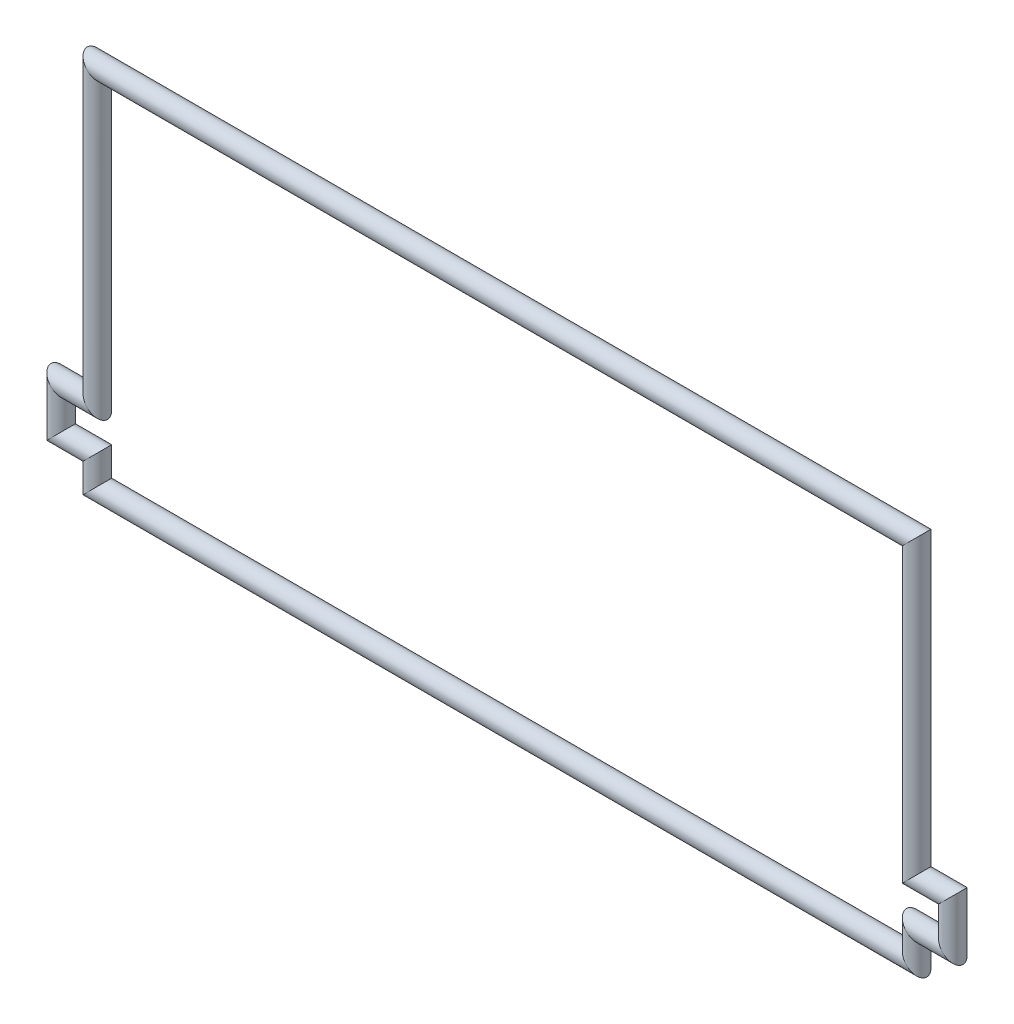
ISO-10303-21;
HEADER;
FILE_DESCRIPTION(('STEP AP214'),'2;1');
FILE_NAME('part.step','',(''),(''),'','','');
FILE_SCHEMA(('AUTOMOTIVE_DESIGN { 1 0 10303 214 1 1 1 1 }'));
ENDSEC;
DATA;
#1=APPLICATION_CONTEXT('core data for automotive mechanical design processes');
#2=APPLICATION_PROTOCOL_DEFINITION('international standard','automotive_design',2000,#1);
#3=PRODUCT_CONTEXT('',#1,'mechanical');
#4=PRODUCT('Part','Part','',(#3));
#5=PRODUCT_RELATED_PRODUCT_CATEGORY('part','',(#4));
#6=PRODUCT_DEFINITION_FORMATION('','',#4);
#7=PRODUCT_DEFINITION_CONTEXT('part definition',#1,'design');
#8=PRODUCT_DEFINITION('design','',#6,#7);
#9=PRODUCT_DEFINITION_SHAPE('','',#8);
#10=(LENGTH_UNIT() NAMED_UNIT(*) SI_UNIT(.MILLI.,.METRE.));
#11=(NAMED_UNIT(*) PLANE_ANGLE_UNIT() SI_UNIT($,.RADIAN.));
#12=(NAMED_UNIT(*) SI_UNIT($,.STERADIAN.) SOLID_ANGLE_UNIT());
#13=UNCERTAINTY_MEASURE_WITH_UNIT(LENGTH_MEASURE(1.E-05),#10,'distance_accuracy_value','');
#14=(GEOMETRIC_REPRESENTATION_CONTEXT(3) GLOBAL_UNCERTAINTY_ASSIGNED_CONTEXT((#13)) GLOBAL_UNIT_ASSIGNED_CONTEXT((#10,
#11,#12)) REPRESENTATION_CONTEXT('',''));
#15=CARTESIAN_POINT('',(0.,0.,0.));
#16=DIRECTION('',(0.,0.,1.));
#17=DIRECTION('',(1.,0.,0.));
#18=AXIS2_PLACEMENT_3D('',#15,#16,#17);
#19=CARTESIAN_POINT('',(58.14,25.2,0.));
#20=DIRECTION('',(-1.,0.,0.));
#21=DIRECTION('',(0.,0.,1.));
#22=AXIS2_PLACEMENT_3D('',#19,#20,#21);
#23=CYLINDRICAL_SURFACE('',#22,0.7);
#24=CARTESIAN_POINT('',(56.5,25.2,0.));
#25=DIRECTION('',(-0.707106781186548,0.707106781186547,0.));
#26=DIRECTION('',(0.707106781186547,0.707106781186548,0.));
#27=AXIS2_PLACEMENT_3D('',#24,#25,#26);
#28=ELLIPSE('',#27,0.989949493661166,0.7);
#29=CARTESIAN_POINT('',(57.2,25.9,0.));
#30=VERTEX_POINT('',#29);
#31=EDGE_CURVE('E60',#30,#30,#28,.F.);
#32=ORIENTED_EDGE('',*,*,#31,.F.);
#33=EDGE_LOOP('',(#32));
#34=FACE_BOUND('',#33,.T.);
#35=CARTESIAN_POINT('',(0.,25.2,0.));
#36=DIRECTION('',(-0.707106781186548,-0.707106781186548,0.));
#37=DIRECTION('',(0.707106781186548,-0.707106781186548,0.));
#38=AXIS2_PLACEMENT_3D('',#35,#36,#37);
#39=ELLIPSE('',#38,0.989949493661167,0.7);
#40=CARTESIAN_POINT('',(0.700000000000038,24.5,0.));
#41=VERTEX_POINT('',#40);
#42=EDGE_CURVE('E45',#41,#41,#39,.F.);
#43=ORIENTED_EDGE('',*,*,#42,.T.);
#44=EDGE_LOOP('',(#43));
#45=FACE_BOUND('',#44,.T.);
#46=ADVANCED_FACE('F42',(#34,#45),#23,.T.);
#47=CARTESIAN_POINT('',(0.,26.84,0.));
#48=DIRECTION('',(0.,-1.,0.));
#49=DIRECTION('',(0.,0.,-1.));
#50=AXIS2_PLACEMENT_3D('',#47,#48,#49);
#51=CYLINDRICAL_SURFACE('',#50,0.7);
#52=ORIENTED_EDGE('',*,*,#42,.F.);
#53=EDGE_LOOP('',(#52));
#54=FACE_BOUND('',#53,.T.);
#55=CARTESIAN_POINT('',(0.,5.04999999999996,0.));
#56=DIRECTION('',(-0.707106781186547,-0.707106781186547,0.));
#57=DIRECTION('',(-0.707106781186548,0.707106781186548,0.));
#58=AXIS2_PLACEMENT_3D('',#55,#56,#57);
#59=ELLIPSE('',#58,0.989949493661167,0.7);
#60=CARTESIAN_POINT('',(-0.699999999999961,5.74999999999996,0.));
#61=VERTEX_POINT('',#60);
#62=EDGE_CURVE('E143',#61,#61,#59,.F.);
#63=ORIENTED_EDGE('',*,*,#62,.T.);
#64=EDGE_LOOP('',(#63));
#65=FACE_BOUND('',#64,.T.);
#66=ADVANCED_FACE('F134',(#54,#65),#51,.T.);
#67=CARTESIAN_POINT('',(56.5,3.40999999999997,0.));
#68=DIRECTION('',(0.,1.,0.));
#69=DIRECTION('',(-1.,0.,0.));
#70=AXIS2_PLACEMENT_3D('',#67,#68,#69);
#71=CYLINDRICAL_SURFACE('',#70,0.7);
#72=CARTESIAN_POINT('',(56.5,5.04999999999998,0.));
#73=DIRECTION('',(-0.707106781186548,0.707106781186547,0.));
#74=DIRECTION('',(-0.707106781186547,-0.707106781186548,0.));
#75=AXIS2_PLACEMENT_3D('',#72,#73,#74);
#76=ELLIPSE('',#75,0.989949493661167,0.7);
#77=CARTESIAN_POINT('',(55.8,4.34999999999998,0.));
#78=VERTEX_POINT('',#77);
#79=EDGE_CURVE('E144',#78,#78,#76,.F.);
#80=ORIENTED_EDGE('',*,*,#79,.F.);
#81=EDGE_LOOP('',(#80));
#82=FACE_BOUND('',#81,.T.);
#83=ORIENTED_EDGE('',*,*,#31,.T.);
#84=EDGE_LOOP('',(#83));
#85=FACE_BOUND('',#84,.T.);
#86=ADVANCED_FACE('F131',(#82,#85),#71,.T.);
#87=CARTESIAN_POINT('',(1.64000000000004,5.04999999999996,0.));
#88=DIRECTION('',(-1.,0.,0.));
#89=DIRECTION('',(0.,0.,1.));
#90=AXIS2_PLACEMENT_3D('',#87,#88,#89);
#91=CYLINDRICAL_SURFACE('',#90,0.7);
#92=ORIENTED_EDGE('',*,*,#62,.F.);
#93=EDGE_LOOP('',(#92));
#94=FACE_BOUND('',#93,.T.);
#95=CARTESIAN_POINT('',(-2.49999999999996,5.04999999999996,0.));
#96=DIRECTION('',(-0.707106781186548,-0.707106781186548,0.));
#97=DIRECTION('',(0.707106781186548,-0.707106781186548,0.));
#98=AXIS2_PLACEMENT_3D('',#95,#96,#97);
#99=ELLIPSE('',#98,0.989949493661167,0.7);
#100=CARTESIAN_POINT('',(-1.79999999999996,4.34999999999996,0.));
#101=VERTEX_POINT('',#100);
#102=EDGE_CURVE('E147',#101,#101,#99,.F.);
#103=ORIENTED_EDGE('',*,*,#102,.T.);
#104=EDGE_LOOP('',(#103));
#105=FACE_BOUND('',#104,.T.);
#106=ADVANCED_FACE('F127',(#94,#105),#91,.T.);
#107=CARTESIAN_POINT('',(60.64,5.04999999999998,0.));
#108=DIRECTION('',(-1.,0.,0.));
#109=DIRECTION('',(0.,-1.,0.));
#110=AXIS2_PLACEMENT_3D('',#107,#108,#109);
#111=CYLINDRICAL_SURFACE('',#110,0.7);
#112=CARTESIAN_POINT('',(59.,5.04999999999998,0.));
#113=DIRECTION('',(-0.707106781186548,0.707106781186547,0.));
#114=DIRECTION('',(0.707106781186547,0.707106781186548,0.));
#115=AXIS2_PLACEMENT_3D('',#112,#113,#114);
#116=ELLIPSE('',#115,0.989949493661167,0.7);
#117=CARTESIAN_POINT('',(59.7,5.74999999999998,0.));
#118=VERTEX_POINT('',#117);
#119=EDGE_CURVE('E151',#118,#118,#116,.F.);
#120=ORIENTED_EDGE('',*,*,#119,.F.);
#121=EDGE_LOOP('',(#120));
#122=FACE_BOUND('',#121,.T.);
#123=ORIENTED_EDGE('',*,*,#79,.T.);
#124=EDGE_LOOP('',(#123));
#125=FACE_BOUND('',#124,.T.);
#126=ADVANCED_FACE('F123',(#122,#125),#111,.T.);
#127=CARTESIAN_POINT('',(-2.49999999999996,6.68999999999996,0.));
#128=DIRECTION('',(0.,-1.,0.));
#129=DIRECTION('',(0.,0.,-1.));
#130=AXIS2_PLACEMENT_3D('',#127,#128,#129);
#131=CYLINDRICAL_SURFACE('',#130,0.7);
#132=ORIENTED_EDGE('',*,*,#102,.F.);
#133=EDGE_LOOP('',(#132));
#134=FACE_BOUND('',#133,.T.);
#135=CARTESIAN_POINT('',(-2.49999999999996,2.00000000000004,0.));
#136=DIRECTION('',(0.707106781186547,-0.707106781186548,0.));
#137=DIRECTION('',(0.707106781186548,0.707106781186547,0.));
#138=AXIS2_PLACEMENT_3D('',#135,#136,#137);
#139=ELLIPSE('',#138,0.989949493661167,0.7);
#140=CARTESIAN_POINT('',(-1.79999999999996,2.70000000000004,0.));
#141=VERTEX_POINT('',#140);
#142=EDGE_CURVE('E154',#141,#141,#139,.F.);
#143=ORIENTED_EDGE('',*,*,#142,.T.);
#144=EDGE_LOOP('',(#143));
#145=FACE_BOUND('',#144,.T.);
#146=ADVANCED_FACE('F119',(#134,#145),#131,.T.);
#147=CARTESIAN_POINT('',(59.,0.36000000000004,0.));
#148=DIRECTION('',(0.,1.,0.));
#149=DIRECTION('',(0.,0.,1.));
#150=AXIS2_PLACEMENT_3D('',#147,#148,#149);
#151=CYLINDRICAL_SURFACE('',#150,0.7);
#152=CARTESIAN_POINT('',(59.,2.00000000000003,0.));
#153=DIRECTION('',(0.707106781186547,0.707106781186548,0.));
#154=DIRECTION('',(0.707106781186548,-0.707106781186547,0.));
#155=AXIS2_PLACEMENT_3D('',#152,#153,#154);
#156=ELLIPSE('',#155,0.989949493661167,0.7);
#157=CARTESIAN_POINT('',(59.7,1.30000000000003,0.));
#158=VERTEX_POINT('',#157);
#159=EDGE_CURVE('E156',#158,#158,#156,.F.);
#160=ORIENTED_EDGE('',*,*,#159,.F.);
#161=EDGE_LOOP('',(#160));
#162=FACE_BOUND('',#161,.T.);
#163=ORIENTED_EDGE('',*,*,#119,.T.);
#164=EDGE_LOOP('',(#163));
#165=FACE_BOUND('',#164,.T.);
#166=ADVANCED_FACE('F115',(#162,#165),#151,.T.);
#167=CARTESIAN_POINT('',(-4.13999999999995,2.00000000000004,0.));
#168=DIRECTION('',(1.,0.,0.));
#169=DIRECTION('',(0.,1.,0.));
#170=AXIS2_PLACEMENT_3D('',#167,#168,#169);
#171=CYLINDRICAL_SURFACE('',#170,0.7);
#172=ORIENTED_EDGE('',*,*,#142,.F.);
#173=EDGE_LOOP('',(#172));
#174=FACE_BOUND('',#173,.T.);
#175=CARTESIAN_POINT('',(0.,2.00000000000004,0.));
#176=DIRECTION('',(0.707106781186547,-0.707106781186548,0.));
#177=DIRECTION('',(-0.707106781186548,-0.707106781186547,0.));
#178=AXIS2_PLACEMENT_3D('',#175,#176,#177);
#179=ELLIPSE('',#178,0.989949493661166,0.7);
#180=CARTESIAN_POINT('',(-0.69999999999996,1.30000000000004,0.));
#181=VERTEX_POINT('',#180);
#182=EDGE_CURVE('E159',#181,#181,#179,.F.);
#183=ORIENTED_EDGE('',*,*,#182,.T.);
#184=EDGE_LOOP('',(#183));
#185=FACE_BOUND('',#184,.T.);
#186=ADVANCED_FACE('F111',(#174,#185),#171,.T.);
#187=CARTESIAN_POINT('',(54.86,2.00000000000003,0.));
#188=DIRECTION('',(1.,0.,0.));
#189=DIRECTION('',(0.,1.,0.));
#190=AXIS2_PLACEMENT_3D('',#187,#188,#189);
#191=CYLINDRICAL_SURFACE('',#190,0.7);
#192=CARTESIAN_POINT('',(56.5,2.00000000000001,0.));
#193=DIRECTION('',(0.707106781186547,0.707106781186548,0.));
#194=DIRECTION('',(-0.707106781186548,0.707106781186547,0.));
#195=AXIS2_PLACEMENT_3D('',#192,#193,#194);
#196=ELLIPSE('',#195,0.989949493661166,0.7);
#197=CARTESIAN_POINT('',(55.8,2.70000000000001,0.));
#198=VERTEX_POINT('',#197);
#199=EDGE_CURVE('E161',#198,#198,#196,.F.);
#200=ORIENTED_EDGE('',*,*,#199,.F.);
#201=EDGE_LOOP('',(#200));
#202=FACE_BOUND('',#201,.T.);
#203=ORIENTED_EDGE('',*,*,#159,.T.);
#204=EDGE_LOOP('',(#203));
#205=FACE_BOUND('',#204,.T.);
#206=ADVANCED_FACE('F107',(#202,#205),#191,.T.);
#207=CARTESIAN_POINT('',(0.,3.64000000000004,0.));
#208=DIRECTION('',(0.,-1.,0.));
#209=DIRECTION('',(0.,0.,-1.));
#210=AXIS2_PLACEMENT_3D('',#207,#208,#209);
#211=CYLINDRICAL_SURFACE('',#210,0.7);
#212=ORIENTED_EDGE('',*,*,#182,.F.);
#213=EDGE_LOOP('',(#212));
#214=FACE_BOUND('',#213,.T.);
#215=CARTESIAN_POINT('',(0.,0.,0.));
#216=DIRECTION('',(0.707106781186548,-0.707106781186547,0.));
#217=DIRECTION('',(0.707106781186547,0.707106781186548,0.));
#218=AXIS2_PLACEMENT_3D('',#215,#216,#217);
#219=ELLIPSE('',#218,0.989949493661167,0.7);
#220=CARTESIAN_POINT('',(0.7,0.7,0.));
#221=VERTEX_POINT('',#220);
#222=EDGE_CURVE('E50',#221,#221,#219,.F.);
#223=ORIENTED_EDGE('',*,*,#222,.T.);
#224=EDGE_LOOP('',(#223));
#225=FACE_BOUND('',#224,.T.);
#226=ADVANCED_FACE('F101',(#214,#225),#211,.T.);
#227=CARTESIAN_POINT('',(56.5,-1.63999999999998,0.));
#228=DIRECTION('',(0.,1.,0.));
#229=DIRECTION('',(0.,0.,1.));
#230=AXIS2_PLACEMENT_3D('',#227,#228,#229);
#231=CYLINDRICAL_SURFACE('',#230,0.7);
#232=CARTESIAN_POINT('',(56.5,0.,0.));
#233=DIRECTION('',(0.707106781186547,0.707106781186548,0.));
#234=DIRECTION('',(0.707106781186548,-0.707106781186547,0.));
#235=AXIS2_PLACEMENT_3D('',#232,#233,#234);
#236=ELLIPSE('',#235,0.989949493661167,0.7);
#237=CARTESIAN_POINT('',(57.2,-0.699999999999993,0.));
#238=VERTEX_POINT('',#237);
#239=EDGE_CURVE('E13',#238,#238,#236,.F.);
#240=ORIENTED_EDGE('',*,*,#239,.F.);
#241=EDGE_LOOP('',(#240));
#242=FACE_BOUND('',#241,.T.);
#243=ORIENTED_EDGE('',*,*,#199,.T.);
#244=EDGE_LOOP('',(#243));
#245=FACE_BOUND('',#244,.T.);
#246=ADVANCED_FACE('F91',(#242,#245),#231,.T.);
#247=CARTESIAN_POINT('',(-1.64,0.,0.));
#248=DIRECTION('',(1.,0.,0.));
#249=DIRECTION('',(0.,1.,0.));
#250=AXIS2_PLACEMENT_3D('',#247,#248,#249);
#251=CYLINDRICAL_SURFACE('',#250,0.7);
#252=ORIENTED_EDGE('',*,*,#222,.F.);
#253=EDGE_LOOP('',(#252));
#254=FACE_BOUND('',#253,.T.);
#255=ORIENTED_EDGE('',*,*,#239,.T.);
#256=EDGE_LOOP('',(#255));
#257=FACE_BOUND('',#256,.T.);
#258=ADVANCED_FACE('F94',(#254,#257),#251,.T.);
#259=CLOSED_SHELL('',(#46,#66,#86,#106,#126,#146,#166,#186,#206,#226,#246,#258));
#260=MANIFOLD_SOLID_BREP('B2',#259);
#261=ADVANCED_BREP_SHAPE_REPRESENTATION('',(#18,#260),#14);
#262=SHAPE_DEFINITION_REPRESENTATION(#9,#261);
ENDSEC;
END-ISO-10303-21;
